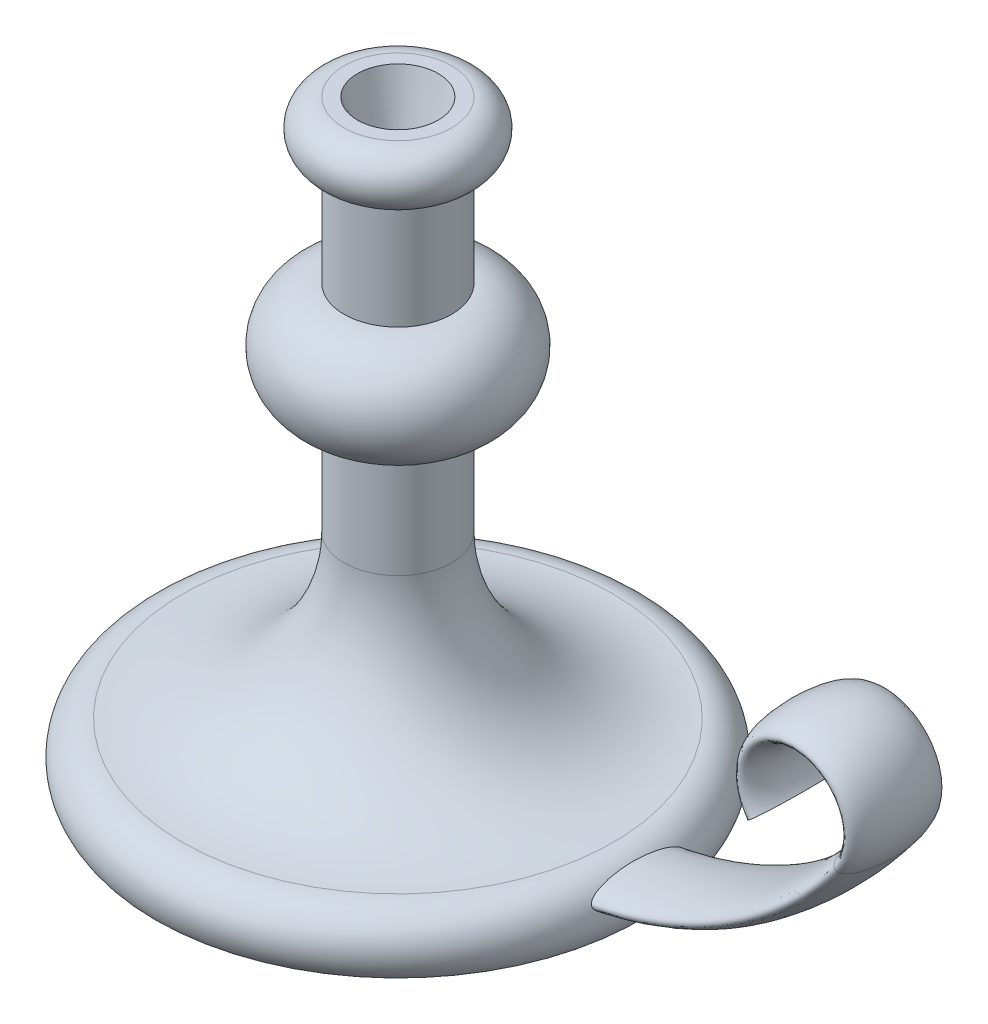
ISO-10303-21;
HEADER;
FILE_DESCRIPTION(('STEP AP214'),'2;1');
FILE_NAME('part.step','',(''),(''),'','','');
FILE_SCHEMA(('AUTOMOTIVE_DESIGN { 1 0 10303 214 1 1 1 1 }'));
ENDSEC;
DATA;
#1=APPLICATION_CONTEXT('core data for automotive mechanical design processes');
#2=APPLICATION_PROTOCOL_DEFINITION('international standard','automotive_design',2000,#1);
#3=PRODUCT_CONTEXT('',#1,'mechanical');
#4=PRODUCT('Part','Part','',(#3));
#5=PRODUCT_RELATED_PRODUCT_CATEGORY('part','',(#4));
#6=PRODUCT_DEFINITION_FORMATION('','',#4);
#7=PRODUCT_DEFINITION_CONTEXT('part definition',#1,'design');
#8=PRODUCT_DEFINITION('design','',#6,#7);
#9=PRODUCT_DEFINITION_SHAPE('','',#8);
#10=(LENGTH_UNIT() NAMED_UNIT(*) SI_UNIT(.MILLI.,.METRE.));
#11=(NAMED_UNIT(*) PLANE_ANGLE_UNIT() SI_UNIT($,.RADIAN.));
#12=(NAMED_UNIT(*) SI_UNIT($,.STERADIAN.) SOLID_ANGLE_UNIT());
#13=UNCERTAINTY_MEASURE_WITH_UNIT(LENGTH_MEASURE(1.E-05),#10,'distance_accuracy_value','');
#14=(GEOMETRIC_REPRESENTATION_CONTEXT(3) GLOBAL_UNCERTAINTY_ASSIGNED_CONTEXT((#13)) GLOBAL_UNIT_ASSIGNED_CONTEXT((#10,
#11,#12)) REPRESENTATION_CONTEXT('',''));
#15=CARTESIAN_POINT('',(0.,0.,0.));
#16=DIRECTION('',(0.,0.,1.));
#17=DIRECTION('',(1.,0.,0.));
#18=AXIS2_PLACEMENT_3D('',#15,#16,#17);
#19=CARTESIAN_POINT('',(0.,0.,0.));
#20=DIRECTION('',(0.,-1.,0.));
#21=DIRECTION('',(0.,0.,-1.));
#22=AXIS2_PLACEMENT_3D('',#19,#20,#21);
#23=PLANE('',#22);
#24=CARTESIAN_POINT('',(0.,0.,0.));
#25=DIRECTION('',(0.,-1.,0.));
#26=DIRECTION('',(0.,0.,-1.));
#27=AXIS2_PLACEMENT_3D('',#24,#25,#26);
#28=CIRCLE('',#27,90.);
#29=CARTESIAN_POINT('',(0.,0.,-90.));
#30=VERTEX_POINT('',#29);
#31=EDGE_CURVE('E69',#30,#30,#28,.T.);
#32=ORIENTED_EDGE('',*,*,#31,.T.);
#33=EDGE_LOOP('',(#32));
#34=FACE_BOUND('',#33,.T.);
#35=ADVANCED_FACE('F36',(#34),#23,.T.);
#36=CARTESIAN_POINT('',(0.,220.,0.));
#37=DIRECTION('',(0.,1.,0.));
#38=DIRECTION('',(0.,0.,1.));
#39=AXIS2_PLACEMENT_3D('',#36,#37,#38);
#40=PLANE('',#39);
#41=CARTESIAN_POINT('',(0.,220.,0.));
#42=DIRECTION('',(0.,1.,0.));
#43=DIRECTION('',(0.,0.,1.));
#44=AXIS2_PLACEMENT_3D('',#41,#42,#43);
#45=CIRCLE('',#44,15.);
#46=CARTESIAN_POINT('',(0.,220.,15.));
#47=VERTEX_POINT('',#46);
#48=EDGE_CURVE('E81',#47,#47,#45,.T.);
#49=ORIENTED_EDGE('',*,*,#48,.F.);
#50=EDGE_LOOP('',(#49));
#51=FACE_BOUND('',#50,.T.);
#52=CARTESIAN_POINT('',(0.,220.,0.));
#53=DIRECTION('',(0.,-1.,0.));
#54=DIRECTION('',(0.,0.,-1.));
#55=AXIS2_PLACEMENT_3D('',#52,#53,#54);
#56=CIRCLE('',#55,20.);
#57=CARTESIAN_POINT('',(0.,220.,-20.));
#58=VERTEX_POINT('',#57);
#59=EDGE_CURVE('E47',#58,#58,#56,.T.);
#60=ORIENTED_EDGE('',*,*,#59,.F.);
#61=EDGE_LOOP('',(#60));
#62=FACE_BOUND('',#61,.T.);
#63=ADVANCED_FACE('F87',(#51,#62),#40,.T.);
#64=CARTESIAN_POINT('',(0.,210.,0.));
#65=DIRECTION('',(0.,-1.,0.));
#66=DIRECTION('',(0.,0.,-1.));
#67=AXIS2_PLACEMENT_3D('',#64,#65,#66);
#68=TOROIDAL_SURFACE('',#67,20.,10.);
#69=ORIENTED_EDGE('',*,*,#59,.T.);
#70=EDGE_LOOP('',(#69));
#71=FACE_BOUND('',#70,.T.);
#72=CARTESIAN_POINT('',(0.,200.,0.));
#73=DIRECTION('',(0.,-1.,0.));
#74=DIRECTION('',(0.,0.,-1.));
#75=AXIS2_PLACEMENT_3D('',#72,#73,#74);
#76=CIRCLE('',#75,20.);
#77=CARTESIAN_POINT('',(0.,200.,-20.));
#78=VERTEX_POINT('',#77);
#79=EDGE_CURVE('E51',#78,#78,#76,.T.);
#80=ORIENTED_EDGE('',*,*,#79,.F.);
#81=EDGE_LOOP('',(#80));
#82=FACE_BOUND('',#81,.T.);
#83=ADVANCED_FACE('F90',(#71,#82),#68,.T.);
#84=CARTESIAN_POINT('',(0.,0.,0.));
#85=DIRECTION('',(0.,-1.,0.));
#86=DIRECTION('',(0.,0.,-1.));
#87=AXIS2_PLACEMENT_3D('',#84,#85,#86);
#88=CYLINDRICAL_SURFACE('',#87,20.);
#89=ORIENTED_EDGE('',*,*,#79,.T.);
#90=EDGE_LOOP('',(#89));
#91=FACE_BOUND('',#90,.T.);
#92=CARTESIAN_POINT('',(0.,160.,0.));
#93=DIRECTION('',(0.,-1.,0.));
#94=DIRECTION('',(0.,0.,-1.));
#95=AXIS2_PLACEMENT_3D('',#92,#93,#94);
#96=CIRCLE('',#95,20.);
#97=CARTESIAN_POINT('',(0.,160.,-20.));
#98=VERTEX_POINT('',#97);
#99=EDGE_CURVE('E55',#98,#98,#96,.T.);
#100=ORIENTED_EDGE('',*,*,#99,.F.);
#101=EDGE_LOOP('',(#100));
#102=FACE_BOUND('',#101,.T.);
#103=ADVANCED_FACE('F95',(#91,#102),#88,.T.);
#104=CARTESIAN_POINT('',(0.,140.,0.));
#105=DIRECTION('',(0.,-1.,0.));
#106=DIRECTION('',(0.,0.,-1.));
#107=AXIS2_PLACEMENT_3D('',#104,#105,#106);
#108=TOROIDAL_SURFACE('',#107,20.,20.);
#109=ORIENTED_EDGE('',*,*,#99,.T.);
#110=EDGE_LOOP('',(#109));
#111=FACE_BOUND('',#110,.T.);
#112=CARTESIAN_POINT('',(0.,120.,0.));
#113=DIRECTION('',(0.,-1.,0.));
#114=DIRECTION('',(0.,0.,-1.));
#115=AXIS2_PLACEMENT_3D('',#112,#113,#114);
#116=CIRCLE('',#115,20.);
#117=CARTESIAN_POINT('',(0.,120.,-20.));
#118=VERTEX_POINT('',#117);
#119=EDGE_CURVE('E60',#118,#118,#116,.T.);
#120=ORIENTED_EDGE('',*,*,#119,.F.);
#121=EDGE_LOOP('',(#120));
#122=FACE_BOUND('',#121,.T.);
#123=ADVANCED_FACE('F101',(#111,#122),#108,.T.);
#124=CARTESIAN_POINT('',(0.,0.,0.));
#125=DIRECTION('',(0.,-1.,0.));
#126=DIRECTION('',(0.,0.,-1.));
#127=AXIS2_PLACEMENT_3D('',#124,#125,#126);
#128=CYLINDRICAL_SURFACE('',#127,20.);
#129=ORIENTED_EDGE('',*,*,#119,.T.);
#130=EDGE_LOOP('',(#129));
#131=FACE_BOUND('',#130,.T.);
#132=CARTESIAN_POINT('',(0.,80.,0.));
#133=DIRECTION('',(0.,-1.,0.));
#134=DIRECTION('',(0.,0.,-1.));
#135=AXIS2_PLACEMENT_3D('',#132,#133,#134);
#136=CIRCLE('',#135,20.);
#137=CARTESIAN_POINT('',(0.,80.,-20.));
#138=VERTEX_POINT('',#137);
#139=EDGE_CURVE('E63',#138,#138,#136,.T.);
#140=ORIENTED_EDGE('',*,*,#139,.F.);
#141=EDGE_LOOP('',(#140));
#142=FACE_BOUND('',#141,.T.);
#143=ADVANCED_FACE('F105',(#131,#142),#128,.T.);
#144=CARTESIAN_POINT('',(0.,80.,0.));
#145=DIRECTION('',(0.,-1.,0.));
#146=DIRECTION('',(0.,0.,-1.));
#147=AXIS2_PLACEMENT_3D('',#144,#145,#146);
#148=TOROIDAL_SURFACE('',#147,80.,60.);
#149=ORIENTED_EDGE('',*,*,#139,.T.);
#150=EDGE_LOOP('',(#149));
#151=FACE_BOUND('',#150,.T.);
#152=CARTESIAN_POINT('',(0.,20.,0.));
#153=DIRECTION('',(0.,-1.,0.));
#154=DIRECTION('',(0.,0.,-1.));
#155=AXIS2_PLACEMENT_3D('',#152,#153,#154);
#156=CIRCLE('',#155,80.);
#157=CARTESIAN_POINT('',(0.,20.,-80.));
#158=VERTEX_POINT('',#157);
#159=EDGE_CURVE('E66',#158,#158,#156,.T.);
#160=ORIENTED_EDGE('',*,*,#159,.F.);
#161=EDGE_LOOP('',(#160));
#162=FACE_BOUND('',#161,.T.);
#163=ADVANCED_FACE('F109',(#151,#162),#148,.F.);
#164=CARTESIAN_POINT('',(0.,7.50000000000001,0.));
#165=DIRECTION('',(0.,-1.,0.));
#166=DIRECTION('',(0.,0.,-1.));
#167=AXIS2_PLACEMENT_3D('',#164,#165,#166);
#168=TOROIDAL_SURFACE('',#167,80.,12.5);
#169=CARTESIAN_POINT('',(89.5597422043342,12.9414346567555,-17.5));
#170=CARTESIAN_POINT('',(89.5390618403561,12.9834100865229,-17.4999996776707));
#171=CARTESIAN_POINT('',(89.5184817634659,13.0254349004938,-17.4978446678338));
#172=CARTESIAN_POINT('',(89.4776811982744,13.1092324497794,-17.4892861575811));
#173=CARTESIAN_POINT('',(89.457460843071,13.1510050881611,-17.482881116885));
#174=CARTESIAN_POINT('',(89.397540281121,13.2754779151414,-17.4575154450276));
#175=CARTESIAN_POINT('',(89.3585808220613,13.357332519418,-17.4324042670615));
#176=CARTESIAN_POINT('',(89.2734407804368,13.5379179993389,-17.3597430943198));
#177=CARTESIAN_POINT('',(89.2281116968574,13.6353152430682,-17.3079906529225));
#178=CARTESIAN_POINT('',(89.1421567137609,13.821757010941,-17.1881654215547));
#179=CARTESIAN_POINT('',(89.10154096816,13.9107834263932,-17.1200583326704));
#180=CARTESIAN_POINT('',(89.0298799325304,14.0690063055582,-16.9825317839868));
#181=CARTESIAN_POINT('',(88.9982856031081,14.1392491335227,-16.9145677994464));
#182=CARTESIAN_POINT('',(88.9378435588022,14.2742914925202,-16.7722502997375));
#183=CARTESIAN_POINT('',(88.9089980734782,14.3390866000317,-16.6978916893925));
#184=CARTESIAN_POINT('',(88.8536099995594,14.4639626152392,-16.544217780153));
#185=CARTESIAN_POINT('',(88.8270733532936,14.5240313225779,-16.4648905452803));
#186=CARTESIAN_POINT('',(88.7760376587064,14.6398576639347,-16.302586394246));
#187=CARTESIAN_POINT('',(88.7515379613228,14.6956166708123,-16.219610653644));
#188=CARTESIAN_POINT('',(88.704732820549,14.8023169553036,-16.052427362784));
#189=CARTESIAN_POINT('',(88.6823939519366,14.8533308765833,-15.9682752160745));
#190=CARTESIAN_POINT('',(88.639155365759,14.9521540950118,-15.7977416210759));
#191=CARTESIAN_POINT('',(88.6182558899722,14.9999628537459,-15.711359801597));
#192=CARTESIAN_POINT('',(88.5573681790009,15.1392585624724,-15.4492483073625));
#193=CARTESIAN_POINT('',(88.5192579811328,15.2264609786255,-15.2707999543232));
#194=CARTESIAN_POINT('',(88.4468979005836,15.3916731276291,-14.9088289385943));
#195=CARTESIAN_POINT('',(88.4126513155026,15.4696750103546,-14.725302105289));
#196=CARTESIAN_POINT('',(88.347139159504,15.6182965032923,-14.3538259785735));
#197=CARTESIAN_POINT('',(88.3158872528146,15.6888824046966,-14.1658608782526));
#198=CARTESIAN_POINT('',(88.2560127035516,15.8233792512431,-13.7874003918539));
#199=CARTESIAN_POINT('',(88.2273872233002,15.8872974109118,-13.5969079973401));
#200=CARTESIAN_POINT('',(88.1723348827448,16.0094159388249,-13.2138496737789));
#201=CARTESIAN_POINT('',(88.1459074726896,16.0676177374301,-13.0212842768929));
#202=CARTESIAN_POINT('',(88.0884248304702,16.1932687928887,-12.5849658119246));
#203=CARTESIAN_POINT('',(88.0579162002184,16.2592725226907,-12.3407253521733));
#204=CARTESIAN_POINT('',(87.9994625659013,16.3844358500306,-11.850180346078));
#205=CARTESIAN_POINT('',(87.9715178234088,16.4435947494062,-11.603875591922));
#206=CARTESIAN_POINT('',(87.9178897421858,16.5558889779776,-11.1095299870477));
#207=CARTESIAN_POINT('',(87.8922075114269,16.6090213595568,-10.8614883492398));
#208=CARTESIAN_POINT('',(87.8429155378603,16.7098546386226,-10.3640943607016));
#209=CARTESIAN_POINT('',(87.8193058942812,16.7575552760879,-10.1147419478208));
#210=CARTESIAN_POINT('',(87.7514718906047,16.8930622945828,-9.36631396644878));
#211=CARTESIAN_POINT('',(87.710111419914,16.9735461668201,-8.86564202060291));
#212=CARTESIAN_POINT('',(87.6344118706353,17.1178657179369,-7.86153551840203));
#213=CARTESIAN_POINT('',(87.6000713341079,17.1817048544489,-7.35810155802538));
#214=CARTESIAN_POINT('',(87.5383679228554,17.2943697092708,-6.35225136111846));
#215=CARTESIAN_POINT('',(87.5109639050818,17.3432843238913,-5.84984753787528));
#216=CARTESIAN_POINT('',(87.4628391630611,17.4279603163538,-4.84354228830983));
#217=CARTESIAN_POINT('',(87.4421195253373,17.4637195559667,-4.33964063194062));
#218=CARTESIAN_POINT('',(87.4074386787955,17.5229738360405,-3.33084363885986));
#219=CARTESIAN_POINT('',(87.3934780874882,17.5464677559496,-2.82594821558653));
#220=CARTESIAN_POINT('',(87.3724154174235,17.5817273168609,-1.81615213380775));
#221=CARTESIAN_POINT('',(87.3653059747339,17.5935055508652,-1.31125206554493));
#222=CARTESIAN_POINT('',(87.3579750479624,17.6056484066489,-0.301318309132633));
#223=CARTESIAN_POINT('',(87.357752858235,17.6060141977103,0.203715360026367));
#224=CARTESIAN_POINT('',(87.3641963426439,17.5953454261038,1.21356726554197));
#225=CARTESIAN_POINT('',(87.3708612610896,17.5843121142068,1.71838551945536));
#226=CARTESIAN_POINT('',(87.3886163883338,17.554616306541,2.6069506864988));
#227=CARTESIAN_POINT('',(87.3982690399213,17.5384060734754,2.99081046478867));
#228=CARTESIAN_POINT('',(87.421496688066,17.4990063104014,3.7580700278574));
#229=CARTESIAN_POINT('',(87.4350718235981,17.4758165331044,4.14146979585456));
#230=CARTESIAN_POINT('',(87.4661109016122,17.4221255760208,4.90767543763238));
#231=CARTESIAN_POINT('',(87.4835755913649,17.3916229911934,5.29048118303789));
#232=CARTESIAN_POINT('',(87.52247652696,17.3226675403927,6.05728766608066));
#233=CARTESIAN_POINT('',(87.5439339089184,17.2841722314846,6.44128353835472));
#234=CARTESIAN_POINT('',(87.5907685418077,17.1987228636428,7.20803081067588));
#235=CARTESIAN_POINT('',(87.6161451191906,17.1517702579395,7.59078241304262));
#236=CARTESIAN_POINT('',(87.6708875244929,17.0486132676472,8.35453102594147));
#237=CARTESIAN_POINT('',(87.7002509792865,16.9924143825779,8.73552894189169));
#238=CARTESIAN_POINT('',(87.7555693385742,16.8844873931684,9.40362807317379));
#239=CARTESIAN_POINT('',(87.7806318626291,16.8349635590468,9.69115955865596));
#240=CARTESIAN_POINT('',(87.8333287645208,16.7293167465828,10.2648242071226));
#241=CARTESIAN_POINT('',(87.8609635304672,16.6731927720484,10.5509571522126));
#242=CARTESIAN_POINT('',(87.9190678138249,16.5534902310351,11.1217112831616));
#243=CARTESIAN_POINT('',(87.9495404231885,16.4899035134825,11.4063304543328));
#244=CARTESIAN_POINT('',(88.0137266324376,16.3541216812726,11.973877233948));
#245=CARTESIAN_POINT('',(88.0474477220508,16.2819065762201,12.2567992545902));
#246=CARTESIAN_POINT('',(88.1183718381954,16.1280994435203,12.8175821097592));
#247=CARTESIAN_POINT('',(88.1555499028384,16.0465737963569,13.0954641920686));
#248=CARTESIAN_POINT('',(88.2343580118386,15.8719007074312,13.6468218234691));
#249=CARTESIAN_POINT('',(88.2759857295859,15.7787593350283,13.9202995902186));
#250=CARTESIAN_POINT('',(88.342656822394,15.6283840406488,14.3254052817096));
#251=CARTESIAN_POINT('',(88.3655500017786,15.576562721343,14.4594023169284));
#252=CARTESIAN_POINT('',(88.4129882653634,15.4688611687533,14.7254525655379));
#253=CARTESIAN_POINT('',(88.4375331689951,15.4129813790934,14.8575059894891));
#254=CARTESIAN_POINT('',(88.4884967907573,15.2967269720349,15.1188747284347));
#255=CARTESIAN_POINT('',(88.5149109123159,15.2363633637364,15.2481958098583));
#256=CARTESIAN_POINT('',(88.5700241751772,15.110317900121,15.5037035642085));
#257=CARTESIAN_POINT('',(88.5987227483179,15.0446373670987,15.6298910063177));
#258=CARTESIAN_POINT('',(88.6570151826479,14.9113179601607,15.8704199707063));
#259=CARTESIAN_POINT('',(88.6864417367861,14.8440563407287,15.9850095995264));
#260=CARTESIAN_POINT('',(88.7482816567769,14.7030103830825,16.2094581395956));
#261=CARTESIAN_POINT('',(88.7806974756142,14.6292206899979,16.3193130551172));
#262=CARTESIAN_POINT('',(88.8489097184973,14.4745639616529,16.5315146626626));
#263=CARTESIAN_POINT('',(88.8846785573509,14.3937550191609,16.6339121024919));
#264=CARTESIAN_POINT('',(88.9606113704154,14.2232561160765,16.8291907541924));
#265=CARTESIAN_POINT('',(89.0007675950254,14.1335818404863,16.9220882016584));
#266=CARTESIAN_POINT('',(89.0601235459873,14.0021924630803,17.0411637727686));
#267=CARTESIAN_POINT('',(89.0770574086406,13.9648250339925,17.0732949178271));
#268=CARTESIAN_POINT('',(89.111770404309,13.8885105828121,17.135112920399));
#269=CARTESIAN_POINT('',(89.1295494801999,13.849563667496,17.1647999427303));
#270=CARTESIAN_POINT('',(89.1842722230348,13.7301865324196,17.2496672583032));
#271=CARTESIAN_POINT('',(89.2225929343976,13.6472387371285,17.3006362954168));
#272=CARTESIAN_POINT('',(89.2830198855205,13.5177923286575,17.3659392171785));
#273=CARTESIAN_POINT('',(89.3038035106326,13.4734899832389,17.385944655127));
#274=CARTESIAN_POINT('',(89.3462357272131,13.383549852641,17.4215212318441));
#275=CARTESIAN_POINT('',(89.3678838017237,13.3379128698456,17.4370949768748));
#276=CARTESIAN_POINT('',(89.4119048024241,13.2456714845447,17.4633118273199));
#277=CARTESIAN_POINT('',(89.4342765183817,13.1990687398022,17.4739627514633));
#278=CARTESIAN_POINT('',(89.4796070415907,13.1052444737536,17.4900003628641));
#279=CARTESIAN_POINT('',(89.5025657624809,13.0580230439621,17.495387819971));
#280=CARTESIAN_POINT('',(89.5464271716019,12.9684112208444,17.5004320668286));
#281=CARTESIAN_POINT('',(89.5672934245652,12.9260327119425,17.5006298436875));
#282=CARTESIAN_POINT('',(89.6091580078857,12.8415284156482,17.496667300483));
#283=CARTESIAN_POINT('',(89.6301563797469,12.799402716722,17.4925055351934));
#284=CARTESIAN_POINT('',(89.6721156351431,12.7157496198107,17.479965082583));
#285=CARTESIAN_POINT('',(89.693076501433,12.6742224548787,17.4715847960013));
#286=CARTESIAN_POINT('',(89.7348115258835,12.5920532516237,17.450862522026));
#287=CARTESIAN_POINT('',(89.7555855765781,12.5514117057387,17.4385183877269));
#288=CARTESIAN_POINT('',(89.8013847331778,12.4623676182576,17.4070626989759));
#289=CARTESIAN_POINT('',(89.8263321178975,12.4142402057077,17.3870577635768));
#290=CARTESIAN_POINT('',(89.8756026524763,12.3198942829528,17.3423007335127));
#291=CARTESIAN_POINT('',(89.8999253272692,12.2736772101062,17.3175451406779));
#292=CARTESIAN_POINT('',(89.9718636752116,12.1379719567037,17.2371059859824));
#293=CARTESIAN_POINT('',(90.0184026508769,12.0515209207989,17.1752845379972));
#294=CARTESIAN_POINT('',(90.1015176697339,11.8991704299985,17.0502729237443));
#295=CARTESIAN_POINT('',(90.1385373685486,11.8321383297488,16.9886971231212));
#296=CARTESIAN_POINT('',(90.210486932928,11.703242603495,16.8591573255861));
#297=CARTESIAN_POINT('',(90.24541514088,11.6413830620088,16.7911883686365));
#298=CARTESIAN_POINT('',(90.3133841124367,11.5222099067341,16.6502911436156));
#299=CARTESIAN_POINT('',(90.3464212107126,11.4649050424999,16.5773538074548));
#300=CARTESIAN_POINT('',(90.4107258034175,11.354414326781,16.4277349965837));
#301=CARTESIAN_POINT('',(90.441993749758,11.301227422116,16.3510544874355));
#302=CARTESIAN_POINT('',(90.5066142435689,11.1922810586094,16.1853189525366));
#303=CARTESIAN_POINT('',(90.539765249564,11.1369814833084,16.0958847835328));
#304=CARTESIAN_POINT('',(90.6043042941243,11.0303194621555,15.9140859303202));
#305=CARTESIAN_POINT('',(90.6356921559877,10.9789574107337,15.8217209538331));
#306=CARTESIAN_POINT('',(90.6968383877972,10.8797698841648,15.6347974994409));
#307=CARTESIAN_POINT('',(90.7265992701638,10.8319389137695,15.5402427441415));
#308=CARTESIAN_POINT('',(90.7846969346253,10.7393295137678,15.34923535226));
#309=CARTESIAN_POINT('',(90.8130337948206,10.6945509167064,15.2527828201658));
#310=CARTESIAN_POINT('',(90.8771212205241,10.5940589597546,15.0277319837677));
#311=CARTESIAN_POINT('',(90.912402281966,10.5393328792863,14.8985593440135));
#312=CARTESIAN_POINT('',(90.9809741103803,10.4339610325181,14.6380328432602));
#313=CARTESIAN_POINT('',(91.0142645951404,10.3833158444314,14.5066786763339));
#314=CARTESIAN_POINT('',(91.1115171918215,10.2366440116073,14.1096810918772));
#315=CARTESIAN_POINT('',(91.1727828792968,10.1460018602111,13.8413800425909));
#316=CARTESIAN_POINT('',(91.2892862812462,9.97615455726879,13.2997906638447));
#317=CARTESIAN_POINT('',(91.344520378909,9.89695625887002,13.0264994554524));
#318=CARTESIAN_POINT('',(91.4499805719983,9.7476965486623,12.4748594155935));
#319=CARTESIAN_POINT('',(91.5001780442575,9.67768673077983,12.1964912536684));
#320=CARTESIAN_POINT('',(91.595750191807,9.54592534416352,11.6372393425728));
#321=CARTESIAN_POINT('',(91.6411285723796,9.48416742117595,11.3563577087889));
#322=CARTESIAN_POINT('',(91.7275132616966,9.36779787162514,10.7925089006657));
#323=CARTESIAN_POINT('',(91.7685202729423,9.31318509647889,10.5095420692663));
#324=CARTESIAN_POINT('',(91.8503345045439,9.20520508711772,9.91387150213394));
#325=CARTESIAN_POINT('',(91.8907217744491,9.15249390095779,9.60099168323369));
#326=CARTESIAN_POINT('',(91.9669218199111,9.05389158705501,8.97359688181694));
#327=CARTESIAN_POINT('',(92.0027343661632,9.00800080116108,8.65908181815664));
#328=CARTESIAN_POINT('',(92.0700329889402,8.92240020575279,8.02865568808488));
#329=CARTESIAN_POINT('',(92.1015177516251,8.88269227276168,7.71274422766199));
#330=CARTESIAN_POINT('',(92.1603325838505,8.8089871367928,7.07986626810307));
#331=CARTESIAN_POINT('',(92.1876625005421,8.77499014390475,6.7628997305909));
#332=CARTESIAN_POINT('',(92.2635030013652,8.68114273902075,5.81249868361912));
#333=CARTESIAN_POINT('',(92.3060517448554,8.6291999949217,5.17778747193527));
#334=CARTESIAN_POINT('',(92.3760091017525,8.54431318450674,3.90627938186488));
#335=CARTESIAN_POINT('',(92.403416975023,8.51137004695174,3.26948240304942));
#336=CARTESIAN_POINT('',(92.4435085691828,8.4633170228411,1.9954574177808));
#337=CARTESIAN_POINT('',(92.4562084043366,8.4481876190884,1.35823064985046));
#338=CARTESIAN_POINT('',(92.4671302630246,8.43517103988552,0.0834423270776243));
#339=CARTESIAN_POINT('',(92.4653514271759,8.43728488791035,-0.55411924539133));
#340=CARTESIAN_POINT('',(92.4472853754492,8.45883344750931,-1.82886328297331));
#341=CARTESIAN_POINT('',(92.4309954438923,8.47827140120341,-2.46604565478452));
#342=CARTESIAN_POINT('',(92.3836590626407,8.53514174464813,-3.73902583867378));
#343=CARTESIAN_POINT('',(92.352614080813,8.57257234445242,-4.37482378215886));
#344=CARTESIAN_POINT('',(92.2921790866401,8.64621329195024,-5.36625544461359));
#345=CARTESIAN_POINT('',(92.2680118235606,8.6757873696351,-5.72271555902236));
#346=CARTESIAN_POINT('',(92.2147013952352,8.74146404735423,-6.43465819603645));
#347=CARTESIAN_POINT('',(92.185558383633,8.77756644580572,-6.79014074848315));
#348=CARTESIAN_POINT('',(92.122112704889,8.85679311513386,-7.49983836059794));
#349=CARTESIAN_POINT('',(92.0878103957546,8.89991689880859,-7.85405350646765));
#350=CARTESIAN_POINT('',(92.0137981226247,8.99384143269688,-8.56089767224198));
#351=CARTESIAN_POINT('',(91.9740883343955,9.0446419333902,-8.9135267433161));
#352=CARTESIAN_POINT('',(91.901581824006,9.13842562293757,-9.51226790233365));
#353=CARTESIAN_POINT('',(91.8702370654068,9.17924629619476,-9.75889575934445));
#354=CARTESIAN_POINT('',(91.8045624920054,9.26550036635953,-10.2509419620325));
#355=CARTESIAN_POINT('',(91.7702327567067,9.3109336404181,-10.4963603397399));
#356=CARTESIAN_POINT('',(91.6984266463268,9.40685898724923,-10.9855805665757));
#357=CARTESIAN_POINT('',(91.6609523533813,9.45734771682007,-11.2293833718187));
#358=CARTESIAN_POINT('',(91.5826038967888,9.56401317099068,-11.7151775621067));
#359=CARTESIAN_POINT('',(91.5417298772533,9.62018965451356,-11.9571690234593));
#360=CARTESIAN_POINT('',(91.4386423376743,9.76351210996426,-12.5384162018501));
#361=CARTESIAN_POINT('',(91.3745858903285,9.85386844470789,-12.8765786557787));
#362=CARTESIAN_POINT('',(91.2720163238264,10.0014015523811,-13.3793136041326));
#363=CARTESIAN_POINT('',(91.236709096999,10.0526332971698,-13.5462966135021));
#364=CARTESIAN_POINT('',(91.1637294936454,10.1596261841623,-13.8782853379568));
#365=CARTESIAN_POINT('',(91.1260572231718,10.2153871233023,-14.0432911413087));
#366=CARTESIAN_POINT('',(91.0448513753994,10.3369382727873,-14.384441669314));
#367=CARTESIAN_POINT('',(91.0010908407912,10.4031767890602,-14.5603739146126));
#368=CARTESIAN_POINT('',(90.9100440331643,10.5428509324202,-14.9085311659842));
#369=CARTESIAN_POINT('',(90.8627565865343,10.6162889577868,-15.0807549132324));
#370=CARTESIAN_POINT('',(90.7642492199851,10.7715651970486,-15.4195496037313));
#371=CARTESIAN_POINT('',(90.7130423069864,10.8533759065573,-15.5861368065594));
#372=CARTESIAN_POINT('',(90.605822017211,11.0275348916434,-15.9120386126957));
#373=CARTESIAN_POINT('',(90.5498128203448,11.1198740259085,-16.0713593593331));
#374=CARTESIAN_POINT('',(90.4444082893047,11.2969255920346,-16.3465910082048));
#375=CARTESIAN_POINT('',(90.3961277047701,11.379105510143,-16.4645448336196));
#376=CARTESIAN_POINT('',(90.2950977924844,11.5538633486872,-16.6911566146557));
#377=CARTESIAN_POINT('',(90.2423390562528,11.6464633011958,-16.7997939840172));
#378=CARTESIAN_POINT('',(90.1590440243453,11.7953014200278,-16.9524870890691));
#379=CARTESIAN_POINT('',(90.1303607600845,11.8469859215402,-17.0019977189786));
#380=CARTESIAN_POINT('',(90.0716181087372,11.9538274561515,-17.0963102611103));
#381=CARTESIAN_POINT('',(90.0415584049392,12.0089852895529,-17.1411110817343));
#382=CARTESIAN_POINT('',(89.9801756575593,12.1227246632095,-17.2246441347401));
#383=CARTESIAN_POINT('',(89.9488577537649,12.1812926416254,-17.2633984155375));
#384=CARTESIAN_POINT('',(89.8849549671326,12.3020144005066,-17.3335784406434));
#385=CARTESIAN_POINT('',(89.8523712452271,12.364164919466,-17.3650107233707));
#386=CARTESIAN_POINT('',(89.7981176909032,12.468725801354,-17.4092508881817));
#387=CARTESIAN_POINT('',(89.7767436177654,12.5101841078549,-17.4246893204629));
#388=CARTESIAN_POINT('',(89.7336969050673,12.5942336377181,-17.4515182330194));
#389=CARTESIAN_POINT('',(89.7120243813911,12.6368244270182,-17.4629102408533));
#390=CARTESIAN_POINT('',(89.6685521390582,12.7228207531294,-17.4812886417919));
#391=CARTESIAN_POINT('',(89.6467526103345,12.7662252198271,-17.488280453409));
#392=CARTESIAN_POINT('',(89.6031794397246,12.8535466229689,-17.4976362320133));
#393=CARTESIAN_POINT('',(89.5814057970823,12.8974635440192,-17.5000003376542));
#394=CARTESIAN_POINT('',(89.5597422043342,12.9414346567555,-17.5));
#395=B_SPLINE_CURVE_WITH_KNOTS('',3,(#169,#170,#171,#172,#173,#174,#175,#176,#177,#178,#179,
#180,#181,#182,#183,#184,#185,#186,#187,#188,#189,#190,#191,#192,#193,#194,#195,#196,#197,#198,
#199,#200,#201,#202,#203,#204,#205,#206,#207,#208,#209,#210,#211,#212,#213,#214,#215,#216,#217,
#218,#219,#220,#221,#222,#223,#224,#225,#226,#227,#228,#229,#230,#231,#232,#233,#234,#235,#236,
#237,#238,#239,#240,#241,#242,#243,#244,#245,#246,#247,#248,#249,#250,#251,#252,#253,#254,#255,
#256,#257,#258,#259,#260,#261,#262,#263,#264,#265,#266,#267,#268,#269,#270,#271,#272,#273,#274,
#275,#276,#277,#278,#279,#280,#281,#282,#283,#284,#285,#286,#287,#288,#289,#290,#291,#292,#293,
#294,#295,#296,#297,#298,#299,#300,#301,#302,#303,#304,#305,#306,#307,#308,#309,#310,#311,#312,
#313,#314,#315,#316,#317,#318,#319,#320,#321,#322,#323,#324,#325,#326,#327,#328,#329,#330,#331,
#332,#333,#334,#335,#336,#337,#338,#339,#340,#341,#342,#343,#344,#345,#346,#347,#348,#349,#350,
#351,#352,#353,#354,#355,#356,#357,#358,#359,#360,#361,#362,#363,#364,#365,#366,#367,#368,#369,
#370,#371,#372,#373,#374,#375,#376,#377,#378,#379,#380,#381,#382,#383,#384,#385,#386,#387,#388,
#389,#390,#391,#392,#393,#394),.UNSPECIFIED.,.T.,.F.,(4,2,2,2,2,2,2,2,2,2,2,2,2,2,2,2,2,2,2,2,2,
2,2,2,2,2,2,2,2,2,2,2,2,2,2,2,2,2,2,2,2,2,2,2,2,2,2,2,2,2,2,2,2,2,2,2,2,2,2,2,2,2,2,2,2,2,2,2,2,
2,2,2,2,2,2,2,2,2,2,2,2,2,2,2,2,2,2,2,2,2,2,2,2,2,2,2,2,2,2,2,2,2,2,2,2,2,2,2,2,2,2,2,4),(0.,
0.140326879649323,0.280704643844328,0.561461806499964,0.917225717585824,1.27374235386086,
1.58146302398149,1.88943119593644,2.19816989275478,2.50680983170029,2.80944292372754,
3.11212672643261,3.71838915770199,4.32516518168254,4.93458970782552,5.54334784093547,
6.1519532590666,6.91631911029059,7.68076285707103,8.44557890144743,9.21043154271149,
10.736353022723,12.2619572680854,13.7782885580526,15.2948661984786,16.8115823682405,
18.3266664767787,19.8415953542038,21.3563580231471,22.509250448231,23.6621837256811,
24.8153386988901,25.9747813799634,27.1340250219357,28.2925816429428,29.1710242088842,
30.0495995331118,30.9291435591546,31.8107663507038,32.6864555684211,33.5616891298979,
33.9980703124481,34.4344038665407,34.869699415605,35.3048870393034,35.7129485465617,
36.1213479397356,36.5266413619587,36.9312301321632,37.0874810726013,37.243721467704,
37.5562829439451,37.7147148343193,37.8730533580128,38.0311395270884,38.1892025705743,
38.330714901433,38.4722741597125,38.6138871242243,38.7555769191152,38.9286541005774,
39.1018592207183,39.4485901352341,39.7429975955388,40.0376353818194,40.3328261359411,
40.6279411430426,40.958547980894,41.2891878931735,41.6193018978022,41.9493977775697,
42.3832551508607,42.8171738887979,43.6859467918779,44.5552378220715,45.4292182663378,
46.3025217875298,47.1756847521832,48.1351081860354,49.0945796914545,50.0543418354886,
51.014139278796,52.928336663604,54.8426276125116,56.7548192562847,58.6671243992201,
60.5797874956904,62.492260355774,63.5676819321888,64.643070307191,65.718384094606,
66.7936629380653,67.549430316063,68.3051775707216,69.0604283053799,69.8156470419373,
70.8826765887369,71.4172057561814,71.9517109715343,72.530589486174,73.1096614946446,
73.6868888444004,74.2636187787022,74.7180950553384,75.1735510009097,75.4046853668809,
75.6358731855902,75.8661972266871,76.0963147970923,76.2435550398539,76.3907396389805,
76.537742634799,76.6847412260987),.UNSPECIFIED.);
#396=CARTESIAN_POINT('',(89.5597422043342,12.9414346567555,-17.5));
#397=VERTEX_POINT('',#396);
#398=EDGE_CURVE('E10',#397,#397,#395,.T.);
#399=ORIENTED_EDGE('',*,*,#398,.F.);
#400=EDGE_LOOP('',(#399));
#401=FACE_BOUND('',#400,.T.);
#402=ORIENTED_EDGE('',*,*,#159,.T.);
#403=EDGE_LOOP('',(#402));
#404=FACE_BOUND('',#403,.T.);
#405=ORIENTED_EDGE('',*,*,#31,.F.);
#406=EDGE_LOOP('',(#405));
#407=FACE_BOUND('',#406,.T.);
#408=ADVANCED_FACE('F112',(#401,#404,#407),#168,.T.);
#409=CARTESIAN_POINT('',(148.,70.,0.));
#410=DIRECTION('',(0.600000000000001,-0.799999999999999,0.));
#411=DIRECTION('',(0.,0.,-1.));
#412=AXIS2_PLACEMENT_3D('',#409,#410,#411);
#413=PLANE('',#412);
#414=CARTESIAN_POINT('',(148.,70.,0.));
#415=DIRECTION('',(0.600000000000001,-0.799999999999999,0.));
#416=DIRECTION('',(0.,0.,-1.));
#417=AXIS2_PLACEMENT_3D('',#414,#415,#416);
#418=ELLIPSE('',#417,17.5,5.);
#419=CARTESIAN_POINT('',(148.,70.,-17.5));
#420=VERTEX_POINT('',#419);
#421=EDGE_CURVE('E72',#420,#420,#418,.T.);
#422=ORIENTED_EDGE('',*,*,#421,.T.);
#423=EDGE_LOOP('',(#422));
#424=FACE_BOUND('',#423,.T.);
#425=ADVANCED_FACE('F117',(#424),#413,.T.);
#426=CARTESIAN_POINT('',(60.,10.,-17.5));
#427=CARTESIAN_POINT('',(108.107236977278,9.99999999999999,-17.5));
#428=CARTESIAN_POINT('',(151.135657813633,31.5142104181772,-17.5));
#429=CARTESIAN_POINT('',(180.,70.,-17.5));
#430=CARTESIAN_POINT('',(60.,20.,-17.5));
#431=CARTESIAN_POINT('',(104.90008784546,20.,-17.5));
#432=CARTESIAN_POINT('',(145.059947292724,40.0799297236321,-17.5));
#433=CARTESIAN_POINT('',(172.,76.,-17.5));
#434=CARTESIAN_POINT('',(60.,20.,17.5));
#435=CARTESIAN_POINT('',(104.90008784546,20.,17.5));
#436=CARTESIAN_POINT('',(145.059947292724,40.0799297236321,17.5));
#437=CARTESIAN_POINT('',(172.,76.,17.5));
#438=CARTESIAN_POINT('',(60.,10.,17.5));
#439=CARTESIAN_POINT('',(108.107236977278,9.99999999999999,17.5));
#440=CARTESIAN_POINT('',(151.135657813633,31.5142104181772,17.5));
#441=CARTESIAN_POINT('',(180.,70.,17.5));
#442=CARTESIAN_POINT('',(60.,0.,17.5));
#443=CARTESIAN_POINT('',(111.314386109097,0.,17.5));
#444=CARTESIAN_POINT('',(157.211368334542,22.9484911127224,17.5));
#445=CARTESIAN_POINT('',(188.,64.,17.5));
#446=CARTESIAN_POINT('',(60.,0.,-17.5));
#447=CARTESIAN_POINT('',(111.314386109097,0.,-17.5));
#448=CARTESIAN_POINT('',(157.211368334542,22.9484911127224,-17.5));
#449=CARTESIAN_POINT('',(188.,64.,-17.5));
#450=CARTESIAN_POINT('',(60.,10.,-17.5));
#451=CARTESIAN_POINT('',(108.107236977278,9.99999999999999,-17.5));
#452=CARTESIAN_POINT('',(151.135657813633,31.5142104181772,-17.5));
#453=CARTESIAN_POINT('',(180.,70.,-17.5));
#454=(BOUNDED_SURFACE() B_SPLINE_SURFACE(3,3,((#426,#427,#428,#429),(#430,#431,#432,#433),(#434,
#435,#436,#437),(#438,#439,#440,#441),(#442,#443,#444,#445),(#446,#447,#448,#449),(#450,#451,
#452,#453)),.UNSPECIFIED.,.T.,.F.,.F.) B_SPLINE_SURFACE_WITH_KNOTS((4,3,4),(4,4),(0.,0.5,1.),
(0.,1.),.UNSPECIFIED.) GEOMETRIC_REPRESENTATION_ITEM() RATIONAL_B_SPLINE_SURFACE(((1.,
0.929618127333277,0.929618127333277,1.),(0.333333333333333,0.309872709111092,0.309872709111092,
0.333333333333333),(0.333333333333333,0.309872709111092,0.309872709111092,0.333333333333333),
(1.,0.929618127333277,0.929618127333277,1.),(0.333333333333333,0.309872709111092,
0.309872709111092,0.333333333333333),(0.333333333333333,0.309872709111092,0.309872709111092,
0.333333333333333),(1.,0.929618127333277,0.929618127333277,1.))) REPRESENTATION_ITEM('') SURFACE());
#455=CARTESIAN_POINT('',(180.,70.,0.));
#456=DIRECTION('',(0.6,0.8,0.));
#457=DIRECTION('',(0.,0.,-1.));
#458=AXIS2_PLACEMENT_3D('',#455,#456,#457);
#459=ELLIPSE('',#458,17.5,5.);
#460=CARTESIAN_POINT('',(180.,70.,-17.5));
#461=VERTEX_POINT('',#460);
#462=EDGE_CURVE('E75',#461,#461,#459,.T.);
#463=ORIENTED_EDGE('',*,*,#398,.T.);
#464=EDGE_LOOP('',(#463));
#465=FACE_BOUND('',#464,.T.);
#466=ORIENTED_EDGE('',*,*,#462,.F.);
#467=EDGE_LOOP('',(#466));
#468=FACE_BOUND('',#467,.T.);
#469=ADVANCED_FACE('F122',(#465,#468),#454,.T.);
#470=CARTESIAN_POINT('',(180.,70.,-17.5));
#471=CARTESIAN_POINT('',(191.33126291999,85.1083505599865,-17.5));
#472=CARTESIAN_POINT('',(182.885438199983,102.,-17.5));
#473=CARTESIAN_POINT('',(164.,102.,-17.5));
#474=CARTESIAN_POINT('',(145.114561800017,102.,-17.5));
#475=CARTESIAN_POINT('',(136.66873708001,85.1083505599865,-17.5));
#476=CARTESIAN_POINT('',(148.,70.,-17.5));
#477=CARTESIAN_POINT('',(172.,76.,-17.5));
#478=CARTESIAN_POINT('',(177.665631459995,83.5541752799933,-17.5));
#479=CARTESIAN_POINT('',(173.442719099992,92.,-17.5));
#480=CARTESIAN_POINT('',(164.,92.,-17.5));
#481=CARTESIAN_POINT('',(154.557280900008,92.,-17.5));
#482=CARTESIAN_POINT('',(150.334368540005,83.5541752799932,-17.5));
#483=CARTESIAN_POINT('',(156.,76.,-17.5));
#484=CARTESIAN_POINT('',(172.,76.,17.5));
#485=CARTESIAN_POINT('',(177.665631459995,83.5541752799933,17.5));
#486=CARTESIAN_POINT('',(173.442719099992,92.,17.5));
#487=CARTESIAN_POINT('',(164.,92.,17.5));
#488=CARTESIAN_POINT('',(154.557280900008,92.,17.5));
#489=CARTESIAN_POINT('',(150.334368540005,83.5541752799932,17.5));
#490=CARTESIAN_POINT('',(156.,76.,17.5));
#491=CARTESIAN_POINT('',(180.,70.,17.5));
#492=CARTESIAN_POINT('',(191.33126291999,85.1083505599865,17.5));
#493=CARTESIAN_POINT('',(182.885438199983,102.,17.5));
#494=CARTESIAN_POINT('',(164.,102.,17.5));
#495=CARTESIAN_POINT('',(145.114561800017,102.,17.5));
#496=CARTESIAN_POINT('',(136.66873708001,85.1083505599865,17.5));
#497=CARTESIAN_POINT('',(148.,70.,17.5));
#498=CARTESIAN_POINT('',(188.,64.,17.5));
#499=CARTESIAN_POINT('',(204.996894379985,86.6625258399798,17.5));
#500=CARTESIAN_POINT('',(192.328157299975,112.,17.5));
#501=CARTESIAN_POINT('',(164.,112.,17.5));
#502=CARTESIAN_POINT('',(135.671842700025,112.,17.5));
#503=CARTESIAN_POINT('',(123.003105620015,86.6625258399798,17.5));
#504=CARTESIAN_POINT('',(140.,64.,17.5));
#505=CARTESIAN_POINT('',(188.,64.,-17.5));
#506=CARTESIAN_POINT('',(204.996894379985,86.6625258399798,-17.5));
#507=CARTESIAN_POINT('',(192.328157299975,112.,-17.5));
#508=CARTESIAN_POINT('',(164.,112.,-17.5));
#509=CARTESIAN_POINT('',(135.671842700025,112.,-17.5));
#510=CARTESIAN_POINT('',(123.003105620015,86.6625258399798,-17.5));
#511=CARTESIAN_POINT('',(140.,64.,-17.5));
#512=CARTESIAN_POINT('',(180.,70.,-17.5));
#513=CARTESIAN_POINT('',(191.33126291999,85.1083505599865,-17.5));
#514=CARTESIAN_POINT('',(182.885438199983,102.,-17.5));
#515=CARTESIAN_POINT('',(164.,102.,-17.5));
#516=CARTESIAN_POINT('',(145.114561800017,102.,-17.5));
#517=CARTESIAN_POINT('',(136.66873708001,85.1083505599865,-17.5));
#518=CARTESIAN_POINT('',(148.,70.,-17.5));
#519=(BOUNDED_SURFACE() B_SPLINE_SURFACE(3,3,((#470,#471,#472,#473,#474,#475,#476),(#477,#478,
#479,#480,#481,#482,#483),(#484,#485,#486,#487,#488,#489,#490),(#491,#492,#493,#494,#495,#496,
#497),(#498,#499,#500,#501,#502,#503,#504),(#505,#506,#507,#508,#509,#510,#511),(#512,#513,#514,
#515,#516,#517,#518)),.UNSPECIFIED.,.T.,.F.,.F.) B_SPLINE_SURFACE_WITH_KNOTS((4,3,4),(4,3,4),
(0.,0.5,1.),(0.,0.5,1.),
.UNSPECIFIED.) GEOMETRIC_REPRESENTATION_ITEM() RATIONAL_B_SPLINE_SURFACE(((1.,0.631475730333305,
0.631475730333305,1.,0.631475730333305,0.631475730333305,1.),(0.333333333333333,
0.210491910111102,0.210491910111102,0.333333333333333,0.210491910111102,0.210491910111102,
0.333333333333333),(0.333333333333333,0.210491910111102,0.210491910111102,0.333333333333333,
0.210491910111102,0.210491910111102,0.333333333333333),(1.,0.631475730333305,0.631475730333305,
1.,0.631475730333305,0.631475730333305,1.),(0.333333333333333,0.210491910111102,
0.210491910111102,0.333333333333333,0.210491910111102,0.210491910111102,0.333333333333333),
(0.333333333333333,0.210491910111102,0.210491910111102,0.333333333333333,0.210491910111102,
0.210491910111102,0.333333333333333),(1.,0.631475730333305,0.631475730333305,1.,
0.631475730333305,0.631475730333305,1.))) REPRESENTATION_ITEM('') SURFACE());
#520=ORIENTED_EDGE('',*,*,#421,.F.);
#521=EDGE_LOOP('',(#520));
#522=FACE_BOUND('',#521,.T.);
#523=ORIENTED_EDGE('',*,*,#462,.T.);
#524=EDGE_LOOP('',(#523));
#525=FACE_BOUND('',#524,.T.);
#526=ADVANCED_FACE('F119',(#522,#525),#519,.T.);
#527=CARTESIAN_POINT('',(0.,220.,0.));
#528=DIRECTION('',(0.,1.,0.));
#529=DIRECTION('',(0.,0.,1.));
#530=AXIS2_PLACEMENT_3D('',#527,#528,#529);
#531=CONICAL_SURFACE('',#530,15.,0.26179938779915);
#532=CARTESIAN_POINT('',(0.,195.,0.));
#533=DIRECTION('',(0.,1.,0.));
#534=DIRECTION('',(0.,0.,1.));
#535=AXIS2_PLACEMENT_3D('',#532,#533,#534);
#536=CIRCLE('',#535,8.30127018922192);
#537=CARTESIAN_POINT('',(0.,195.,8.30127018922192));
#538=VERTEX_POINT('',#537);
#539=EDGE_CURVE('E78',#538,#538,#536,.T.);
#540=ORIENTED_EDGE('',*,*,#539,.F.);
#541=EDGE_LOOP('',(#540));
#542=FACE_BOUND('',#541,.T.);
#543=ORIENTED_EDGE('',*,*,#48,.T.);
#544=EDGE_LOOP('',(#543));
#545=FACE_BOUND('',#544,.T.);
#546=ADVANCED_FACE('F85',(#542,#545),#531,.F.);
#547=CARTESIAN_POINT('',(0.,195.,0.));
#548=DIRECTION('',(0.,1.,0.));
#549=DIRECTION('',(0.,0.,1.));
#550=AXIS2_PLACEMENT_3D('',#547,#548,#549);
#551=PLANE('',#550);
#552=ORIENTED_EDGE('',*,*,#539,.T.);
#553=EDGE_LOOP('',(#552));
#554=FACE_BOUND('',#553,.T.);
#555=ADVANCED_FACE('F145',(#554),#551,.T.);
#556=CLOSED_SHELL('',(#35,#63,#83,#103,#123,#143,#163,#408,#425,#469,#526,#546,#555));
#557=MANIFOLD_SOLID_BREP('B2',#556);
#558=ADVANCED_BREP_SHAPE_REPRESENTATION('',(#18,#557),#14);
#559=SHAPE_DEFINITION_REPRESENTATION(#9,#558);
ENDSEC;
END-ISO-10303-21;
